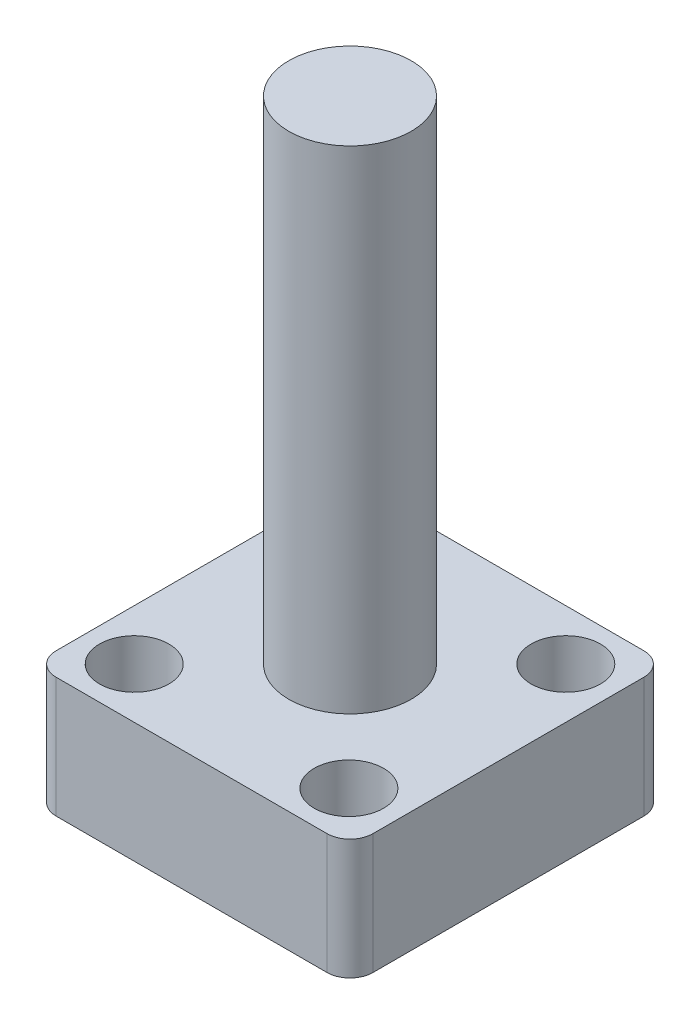
ISO-10303-21;
HEADER;
FILE_DESCRIPTION(('STEP AP214'),'2;1');
FILE_NAME('part.step','',(''),(''),'','','');
FILE_SCHEMA(('AUTOMOTIVE_DESIGN { 1 0 10303 214 1 1 1 1 }'));
ENDSEC;
DATA;
#1=APPLICATION_CONTEXT('core data for automotive mechanical design processes');
#2=APPLICATION_PROTOCOL_DEFINITION('international standard','automotive_design',2000,#1);
#3=PRODUCT_CONTEXT('',#1,'mechanical');
#4=PRODUCT('Part','Part','',(#3));
#5=PRODUCT_RELATED_PRODUCT_CATEGORY('part','',(#4));
#6=PRODUCT_DEFINITION_FORMATION('','',#4);
#7=PRODUCT_DEFINITION_CONTEXT('part definition',#1,'design');
#8=PRODUCT_DEFINITION('design','',#6,#7);
#9=PRODUCT_DEFINITION_SHAPE('','',#8);
#10=(LENGTH_UNIT() NAMED_UNIT(*) SI_UNIT(.MILLI.,.METRE.));
#11=(NAMED_UNIT(*) PLANE_ANGLE_UNIT() SI_UNIT($,.RADIAN.));
#12=(NAMED_UNIT(*) SI_UNIT($,.STERADIAN.) SOLID_ANGLE_UNIT());
#13=UNCERTAINTY_MEASURE_WITH_UNIT(LENGTH_MEASURE(1.E-05),#10,'distance_accuracy_value','');
#14=(GEOMETRIC_REPRESENTATION_CONTEXT(3) GLOBAL_UNCERTAINTY_ASSIGNED_CONTEXT((#13)) GLOBAL_UNIT_ASSIGNED_CONTEXT((#10,
#11,#12)) REPRESENTATION_CONTEXT('',''));
#15=CARTESIAN_POINT('',(0.,0.,0.));
#16=DIRECTION('',(0.,0.,1.));
#17=DIRECTION('',(1.,0.,0.));
#18=AXIS2_PLACEMENT_3D('',#15,#16,#17);
#19=CARTESIAN_POINT('',(-26.289,0.,-26.289));
#20=DIRECTION('',(0.,1.,0.));
#21=DIRECTION('',(0.,0.,1.));
#22=AXIS2_PLACEMENT_3D('',#19,#20,#21);
#23=PLANE('',#22);
#24=DIRECTION('',(0.,0.,1.));
#25=VECTOR('',#24,1.);
#26=CARTESIAN_POINT('',(-26.289,0.,26.289));
#27=LINE('',#26,#25);
#28=CARTESIAN_POINT('',(-26.289,0.,-22.479));
#29=VERTEX_POINT('',#28);
#30=CARTESIAN_POINT('',(-26.289,0.,22.479));
#31=VERTEX_POINT('',#30);
#32=EDGE_CURVE('E128',#29,#31,#27,.T.);
#33=ORIENTED_EDGE('',*,*,#32,.F.);
#34=CARTESIAN_POINT('',(-22.479,0.,-22.479));
#35=DIRECTION('',(0.,1.,0.));
#36=DIRECTION('',(0.,0.,1.));
#37=AXIS2_PLACEMENT_3D('',#34,#35,#36);
#38=CIRCLE('',#37,3.81);
#39=CARTESIAN_POINT('',(-22.479,0.,-26.289));
#40=VERTEX_POINT('',#39);
#41=EDGE_CURVE('E110',#29,#40,#38,.F.);
#42=ORIENTED_EDGE('',*,*,#41,.T.);
#43=DIRECTION('',(-1.,0.,0.));
#44=VECTOR('',#43,1.);
#45=CARTESIAN_POINT('',(26.289,0.,-26.289));
#46=LINE('',#45,#44);
#47=CARTESIAN_POINT('',(22.479,0.,-26.289));
#48=VERTEX_POINT('',#47);
#49=EDGE_CURVE('E157',#48,#40,#46,.T.);
#50=ORIENTED_EDGE('',*,*,#49,.F.);
#51=CARTESIAN_POINT('',(22.479,0.,-22.479));
#52=DIRECTION('',(0.,1.,0.));
#53=DIRECTION('',(0.,0.,1.));
#54=AXIS2_PLACEMENT_3D('',#51,#52,#53);
#55=CIRCLE('',#54,3.81);
#56=CARTESIAN_POINT('',(26.289,0.,-22.479));
#57=VERTEX_POINT('',#56);
#58=EDGE_CURVE('E122',#48,#57,#55,.F.);
#59=ORIENTED_EDGE('',*,*,#58,.T.);
#60=DIRECTION('',(0.,0.,-1.));
#61=VECTOR('',#60,1.);
#62=CARTESIAN_POINT('',(26.289,0.,26.289));
#63=LINE('',#62,#61);
#64=CARTESIAN_POINT('',(26.289,0.,22.479));
#65=VERTEX_POINT('',#64);
#66=EDGE_CURVE('E146',#65,#57,#63,.T.);
#67=ORIENTED_EDGE('',*,*,#66,.F.);
#68=CARTESIAN_POINT('',(22.479,0.,22.479));
#69=DIRECTION('',(0.,1.,0.));
#70=DIRECTION('',(0.,0.,1.));
#71=AXIS2_PLACEMENT_3D('',#68,#69,#70);
#72=CIRCLE('',#71,3.81);
#73=CARTESIAN_POINT('',(22.479,0.,26.289));
#74=VERTEX_POINT('',#73);
#75=EDGE_CURVE('E133',#65,#74,#72,.F.);
#76=ORIENTED_EDGE('',*,*,#75,.T.);
#77=DIRECTION('',(1.,0.,0.));
#78=VECTOR('',#77,1.);
#79=CARTESIAN_POINT('',(26.289,0.,26.289));
#80=LINE('',#79,#78);
#81=CARTESIAN_POINT('',(-22.479,0.,26.289));
#82=VERTEX_POINT('',#81);
#83=EDGE_CURVE('E140',#82,#74,#80,.T.);
#84=ORIENTED_EDGE('',*,*,#83,.F.);
#85=CARTESIAN_POINT('',(-22.479,0.,22.479));
#86=DIRECTION('',(0.,1.,0.));
#87=DIRECTION('',(0.,0.,1.));
#88=AXIS2_PLACEMENT_3D('',#85,#86,#87);
#89=CIRCLE('',#88,3.81);
#90=EDGE_CURVE('E138',#82,#31,#89,.F.);
#91=ORIENTED_EDGE('',*,*,#90,.T.);
#92=EDGE_LOOP('',(#33,#42,#50,#59,#67,#76,#84,#91));
#93=FACE_BOUND('',#92,.T.);
#94=CARTESIAN_POINT('',(-17.907,0.,-17.907));
#95=DIRECTION('',(0.,1.,0.));
#96=DIRECTION('',(0.,0.,1.));
#97=AXIS2_PLACEMENT_3D('',#94,#95,#96);
#98=CIRCLE('',#97,2.667);
#99=CARTESIAN_POINT('',(-17.907,0.,-15.24));
#100=VERTEX_POINT('',#99);
#101=EDGE_CURVE('E141',#100,#100,#98,.T.);
#102=ORIENTED_EDGE('',*,*,#101,.T.);
#103=EDGE_LOOP('',(#102));
#104=FACE_BOUND('',#103,.T.);
#105=CARTESIAN_POINT('',(-17.907,0.,17.907));
#106=DIRECTION('',(0.,1.,0.));
#107=DIRECTION('',(0.,0.,1.));
#108=AXIS2_PLACEMENT_3D('',#105,#106,#107);
#109=CIRCLE('',#108,2.667);
#110=CARTESIAN_POINT('',(-17.907,0.,20.574));
#111=VERTEX_POINT('',#110);
#112=EDGE_CURVE('E149',#111,#111,#109,.T.);
#113=ORIENTED_EDGE('',*,*,#112,.T.);
#114=EDGE_LOOP('',(#113));
#115=FACE_BOUND('',#114,.T.);
#116=CARTESIAN_POINT('',(17.907,0.,-17.907));
#117=DIRECTION('',(0.,1.,0.));
#118=DIRECTION('',(0.,0.,1.));
#119=AXIS2_PLACEMENT_3D('',#116,#117,#118);
#120=CIRCLE('',#119,2.667);
#121=CARTESIAN_POINT('',(17.907,0.,-15.24));
#122=VERTEX_POINT('',#121);
#123=EDGE_CURVE('E222',#122,#122,#120,.T.);
#124=ORIENTED_EDGE('',*,*,#123,.T.);
#125=EDGE_LOOP('',(#124));
#126=FACE_BOUND('',#125,.T.);
#127=CARTESIAN_POINT('',(18.0213147502904,0.,17.6956283391408));
#128=DIRECTION('',(0.,1.,0.));
#129=DIRECTION('',(0.,0.,1.));
#130=AXIS2_PLACEMENT_3D('',#127,#128,#129);
#131=CIRCLE('',#130,2.667);
#132=CARTESIAN_POINT('',(18.0213147502904,0.,20.3626283391408));
#133=VERTEX_POINT('',#132);
#134=EDGE_CURVE('E226',#133,#133,#131,.T.);
#135=ORIENTED_EDGE('',*,*,#134,.T.);
#136=EDGE_LOOP('',(#135));
#137=FACE_BOUND('',#136,.T.);
#138=ADVANCED_FACE('F41',(#93,#104,#115,#126,#137),#23,.F.);
#139=CARTESIAN_POINT('',(-26.289,19.9644,26.289));
#140=DIRECTION('',(1.,0.,0.));
#141=DIRECTION('',(0.,0.,-1.));
#142=AXIS2_PLACEMENT_3D('',#139,#140,#141);
#143=PLANE('',#142);
#144=DIRECTION('',(0.,0.,1.));
#145=VECTOR('',#144,1.);
#146=CARTESIAN_POINT('',(-26.289,19.9644,26.289));
#147=LINE('',#146,#145);
#148=CARTESIAN_POINT('',(-26.289,19.9644,-22.479));
#149=VERTEX_POINT('',#148);
#150=CARTESIAN_POINT('',(-26.289,19.9644,22.479));
#151=VERTEX_POINT('',#150);
#152=EDGE_CURVE('E131',#149,#151,#147,.T.);
#153=ORIENTED_EDGE('',*,*,#152,.F.);
#154=DIRECTION('',(0.,-1.,0.));
#155=VECTOR('',#154,1.);
#156=CARTESIAN_POINT('',(-26.289,19.9644,-22.479));
#157=LINE('',#156,#155);
#158=EDGE_CURVE('E114',#149,#29,#157,.T.);
#159=ORIENTED_EDGE('',*,*,#158,.T.);
#160=ORIENTED_EDGE('',*,*,#32,.T.);
#161=DIRECTION('',(0.,-1.,0.));
#162=VECTOR('',#161,1.);
#163=CARTESIAN_POINT('',(-26.289,19.9644,22.479));
#164=LINE('',#163,#162);
#165=EDGE_CURVE('E134',#31,#151,#164,.F.);
#166=ORIENTED_EDGE('',*,*,#165,.T.);
#167=EDGE_LOOP('',(#153,#159,#160,#166));
#168=FACE_BOUND('',#167,.T.);
#169=ADVANCED_FACE('F127',(#168),#143,.F.);
#170=CARTESIAN_POINT('',(26.289,19.9644,26.289));
#171=DIRECTION('',(0.,0.,-1.));
#172=DIRECTION('',(-1.,0.,0.));
#173=AXIS2_PLACEMENT_3D('',#170,#171,#172);
#174=PLANE('',#173);
#175=DIRECTION('',(1.,0.,0.));
#176=VECTOR('',#175,1.);
#177=CARTESIAN_POINT('',(26.289,19.9644,26.289));
#178=LINE('',#177,#176);
#179=CARTESIAN_POINT('',(-22.479,19.9644,26.289));
#180=VERTEX_POINT('',#179);
#181=CARTESIAN_POINT('',(22.479,19.9644,26.289));
#182=VERTEX_POINT('',#181);
#183=EDGE_CURVE('E195',#180,#182,#178,.T.);
#184=ORIENTED_EDGE('',*,*,#183,.F.);
#185=DIRECTION('',(0.,-1.,0.));
#186=VECTOR('',#185,1.);
#187=CARTESIAN_POINT('',(-22.479,19.9644,26.289));
#188=LINE('',#187,#186);
#189=EDGE_CURVE('E11',#180,#82,#188,.T.);
#190=ORIENTED_EDGE('',*,*,#189,.T.);
#191=ORIENTED_EDGE('',*,*,#83,.T.);
#192=DIRECTION('',(0.,-1.,0.));
#193=VECTOR('',#192,1.);
#194=CARTESIAN_POINT('',(22.479,19.9644,26.289));
#195=LINE('',#194,#193);
#196=EDGE_CURVE('E51',#74,#182,#195,.F.);
#197=ORIENTED_EDGE('',*,*,#196,.T.);
#198=EDGE_LOOP('',(#184,#190,#191,#197));
#199=FACE_BOUND('',#198,.T.);
#200=ADVANCED_FACE('F194',(#199),#174,.F.);
#201=CARTESIAN_POINT('',(26.289,19.9644,26.289));
#202=DIRECTION('',(-1.,0.,0.));
#203=DIRECTION('',(0.,0.,1.));
#204=AXIS2_PLACEMENT_3D('',#201,#202,#203);
#205=PLANE('',#204);
#206=ORIENTED_EDGE('',*,*,#66,.T.);
#207=DIRECTION('',(0.,-1.,0.));
#208=VECTOR('',#207,1.);
#209=CARTESIAN_POINT('',(26.289,19.9644,-22.479));
#210=LINE('',#209,#208);
#211=CARTESIAN_POINT('',(26.289,19.9644,-22.479));
#212=VERTEX_POINT('',#211);
#213=EDGE_CURVE('E58',#57,#212,#210,.F.);
#214=ORIENTED_EDGE('',*,*,#213,.T.);
#215=DIRECTION('',(0.,0.,-1.));
#216=VECTOR('',#215,1.);
#217=CARTESIAN_POINT('',(26.289,19.9644,26.289));
#218=LINE('',#217,#216);
#219=CARTESIAN_POINT('',(26.289,19.9644,22.479));
#220=VERTEX_POINT('',#219);
#221=EDGE_CURVE('E202',#220,#212,#218,.T.);
#222=ORIENTED_EDGE('',*,*,#221,.F.);
#223=DIRECTION('',(0.,-1.,0.));
#224=VECTOR('',#223,1.);
#225=CARTESIAN_POINT('',(26.289,19.9644,22.479));
#226=LINE('',#225,#224);
#227=EDGE_CURVE('E184',#220,#65,#226,.T.);
#228=ORIENTED_EDGE('',*,*,#227,.T.);
#229=EDGE_LOOP('',(#206,#214,#222,#228));
#230=FACE_BOUND('',#229,.T.);
#231=ADVANCED_FACE('F206',(#230),#205,.F.);
#232=CARTESIAN_POINT('',(26.289,19.9644,-26.289));
#233=DIRECTION('',(0.,0.,1.));
#234=DIRECTION('',(1.,0.,0.));
#235=AXIS2_PLACEMENT_3D('',#232,#233,#234);
#236=PLANE('',#235);
#237=ORIENTED_EDGE('',*,*,#49,.T.);
#238=DIRECTION('',(0.,-1.,0.));
#239=VECTOR('',#238,1.);
#240=CARTESIAN_POINT('',(-22.479,19.9644,-26.289));
#241=LINE('',#240,#239);
#242=CARTESIAN_POINT('',(-22.479,19.9644,-26.289));
#243=VERTEX_POINT('',#242);
#244=EDGE_CURVE('E115',#40,#243,#241,.F.);
#245=ORIENTED_EDGE('',*,*,#244,.T.);
#246=DIRECTION('',(-1.,0.,0.));
#247=VECTOR('',#246,1.);
#248=CARTESIAN_POINT('',(26.289,19.9644,-26.289));
#249=LINE('',#248,#247);
#250=CARTESIAN_POINT('',(22.479,19.9644,-26.289));
#251=VERTEX_POINT('',#250);
#252=EDGE_CURVE('E152',#251,#243,#249,.T.);
#253=ORIENTED_EDGE('',*,*,#252,.F.);
#254=DIRECTION('',(0.,-1.,0.));
#255=VECTOR('',#254,1.);
#256=CARTESIAN_POINT('',(22.479,19.9644,-26.289));
#257=LINE('',#256,#255);
#258=EDGE_CURVE('E121',#251,#48,#257,.T.);
#259=ORIENTED_EDGE('',*,*,#258,.T.);
#260=EDGE_LOOP('',(#237,#245,#253,#259));
#261=FACE_BOUND('',#260,.T.);
#262=ADVANCED_FACE('F213',(#261),#236,.F.);
#263=CARTESIAN_POINT('',(-26.289,19.9644,-26.289));
#264=DIRECTION('',(0.,1.,0.));
#265=DIRECTION('',(0.,0.,1.));
#266=AXIS2_PLACEMENT_3D('',#263,#264,#265);
#267=PLANE('',#266);
#268=CARTESIAN_POINT('',(0.,19.9644,0.));
#269=DIRECTION('',(0.,1.,0.));
#270=DIRECTION('',(0.,0.,1.));
#271=AXIS2_PLACEMENT_3D('',#268,#269,#270);
#272=CIRCLE('',#271,10.16);
#273=CARTESIAN_POINT('',(0.,19.9644,10.16));
#274=VERTEX_POINT('',#273);
#275=EDGE_CURVE('E45',#274,#274,#272,.F.);
#276=ORIENTED_EDGE('',*,*,#275,.T.);
#277=EDGE_LOOP('',(#276));
#278=FACE_BOUND('',#277,.T.);
#279=CARTESIAN_POINT('',(17.907,19.9644,-17.907));
#280=DIRECTION('',(0.,1.,0.));
#281=DIRECTION('',(0.,0.,1.));
#282=AXIS2_PLACEMENT_3D('',#279,#280,#281);
#283=CIRCLE('',#282,5.75437);
#284=CARTESIAN_POINT('',(17.907,19.9644,-12.15263));
#285=VERTEX_POINT('',#284);
#286=EDGE_CURVE('E274',#285,#285,#283,.T.);
#287=ORIENTED_EDGE('',*,*,#286,.F.);
#288=EDGE_LOOP('',(#287));
#289=FACE_BOUND('',#288,.T.);
#290=CARTESIAN_POINT('',(17.7728365538147,19.9644,17.9563280903823));
#291=DIRECTION('',(0.,1.,0.));
#292=DIRECTION('',(0.,0.,1.));
#293=AXIS2_PLACEMENT_3D('',#290,#291,#292);
#294=CIRCLE('',#293,5.75437);
#295=CARTESIAN_POINT('',(17.7728365538147,19.9644,23.7106980903823));
#296=VERTEX_POINT('',#295);
#297=EDGE_CURVE('E262',#296,#296,#294,.T.);
#298=ORIENTED_EDGE('',*,*,#297,.F.);
#299=EDGE_LOOP('',(#298));
#300=FACE_BOUND('',#299,.T.);
#301=CARTESIAN_POINT('',(-17.907,19.9644,17.907));
#302=DIRECTION('',(0.,1.,0.));
#303=DIRECTION('',(0.,0.,1.));
#304=AXIS2_PLACEMENT_3D('',#301,#302,#303);
#305=CIRCLE('',#304,5.75437);
#306=CARTESIAN_POINT('',(-17.907,19.9644,23.66137));
#307=VERTEX_POINT('',#306);
#308=EDGE_CURVE('E250',#307,#307,#305,.T.);
#309=ORIENTED_EDGE('',*,*,#308,.F.);
#310=EDGE_LOOP('',(#309));
#311=FACE_BOUND('',#310,.T.);
#312=CARTESIAN_POINT('',(-17.907,19.9644,-17.907));
#313=DIRECTION('',(0.,1.,0.));
#314=DIRECTION('',(0.,0.,1.));
#315=AXIS2_PLACEMENT_3D('',#312,#313,#314);
#316=CIRCLE('',#315,5.75437);
#317=CARTESIAN_POINT('',(-17.907,19.9644,-12.15263));
#318=VERTEX_POINT('',#317);
#319=EDGE_CURVE('E238',#318,#318,#316,.T.);
#320=ORIENTED_EDGE('',*,*,#319,.F.);
#321=EDGE_LOOP('',(#320));
#322=FACE_BOUND('',#321,.T.);
#323=ORIENTED_EDGE('',*,*,#252,.T.);
#324=CARTESIAN_POINT('',(-22.479,19.9644,-22.479));
#325=DIRECTION('',(0.,1.,0.));
#326=DIRECTION('',(0.,0.,1.));
#327=AXIS2_PLACEMENT_3D('',#324,#325,#326);
#328=CIRCLE('',#327,3.81);
#329=EDGE_CURVE('E181',#243,#149,#328,.T.);
#330=ORIENTED_EDGE('',*,*,#329,.T.);
#331=ORIENTED_EDGE('',*,*,#152,.T.);
#332=CARTESIAN_POINT('',(-22.479,19.9644,22.479));
#333=DIRECTION('',(0.,1.,0.));
#334=DIRECTION('',(0.,0.,1.));
#335=AXIS2_PLACEMENT_3D('',#332,#333,#334);
#336=CIRCLE('',#335,3.81);
#337=EDGE_CURVE('E175',#151,#180,#336,.T.);
#338=ORIENTED_EDGE('',*,*,#337,.T.);
#339=ORIENTED_EDGE('',*,*,#183,.T.);
#340=CARTESIAN_POINT('',(22.479,19.9644,22.479));
#341=DIRECTION('',(0.,1.,0.));
#342=DIRECTION('',(0.,0.,1.));
#343=AXIS2_PLACEMENT_3D('',#340,#341,#342);
#344=CIRCLE('',#343,3.81);
#345=EDGE_CURVE('E65',#182,#220,#344,.T.);
#346=ORIENTED_EDGE('',*,*,#345,.T.);
#347=ORIENTED_EDGE('',*,*,#221,.T.);
#348=CARTESIAN_POINT('',(22.479,19.9644,-22.479));
#349=DIRECTION('',(0.,1.,0.));
#350=DIRECTION('',(0.,0.,1.));
#351=AXIS2_PLACEMENT_3D('',#348,#349,#350);
#352=CIRCLE('',#351,3.81);
#353=EDGE_CURVE('E178',#212,#251,#352,.T.);
#354=ORIENTED_EDGE('',*,*,#353,.T.);
#355=EDGE_LOOP('',(#323,#330,#331,#338,#339,#346,#347,#354));
#356=FACE_BOUND('',#355,.T.);
#357=ADVANCED_FACE('F199',(#278,#289,#300,#311,#322,#356),#267,.T.);
#358=CARTESIAN_POINT('',(-17.907,5.7658,-17.907));
#359=DIRECTION('',(0.,-1.,0.));
#360=DIRECTION('',(0.,0.,-1.));
#361=AXIS2_PLACEMENT_3D('',#358,#359,#360);
#362=CYLINDRICAL_SURFACE('',#361,2.667);
#363=CARTESIAN_POINT('',(-17.907,5.7658,-17.907));
#364=DIRECTION('',(0.,1.,0.));
#365=DIRECTION('',(0.,0.,1.));
#366=AXIS2_PLACEMENT_3D('',#363,#364,#365);
#367=CIRCLE('',#366,2.667);
#368=CARTESIAN_POINT('',(-17.907,5.7658,-15.24));
#369=VERTEX_POINT('',#368);
#370=EDGE_CURVE('E230',#369,#369,#367,.T.);
#371=ORIENTED_EDGE('',*,*,#370,.T.);
#372=EDGE_LOOP('',(#371));
#373=FACE_BOUND('',#372,.T.);
#374=ORIENTED_EDGE('',*,*,#101,.F.);
#375=EDGE_LOOP('',(#374));
#376=FACE_BOUND('',#375,.T.);
#377=ADVANCED_FACE('F344',(#373,#376),#362,.F.);
#378=CARTESIAN_POINT('',(-17.907,5.7658,17.907));
#379=DIRECTION('',(0.,-1.,0.));
#380=DIRECTION('',(0.,0.,-1.));
#381=AXIS2_PLACEMENT_3D('',#378,#379,#380);
#382=CYLINDRICAL_SURFACE('',#381,2.667);
#383=CARTESIAN_POINT('',(-17.907,5.7658,17.907));
#384=DIRECTION('',(0.,1.,0.));
#385=DIRECTION('',(0.,0.,1.));
#386=AXIS2_PLACEMENT_3D('',#383,#384,#385);
#387=CIRCLE('',#386,2.667);
#388=CARTESIAN_POINT('',(-17.907,5.7658,20.574));
#389=VERTEX_POINT('',#388);
#390=EDGE_CURVE('E242',#389,#389,#387,.T.);
#391=ORIENTED_EDGE('',*,*,#390,.T.);
#392=EDGE_LOOP('',(#391));
#393=FACE_BOUND('',#392,.T.);
#394=ORIENTED_EDGE('',*,*,#112,.F.);
#395=EDGE_LOOP('',(#394));
#396=FACE_BOUND('',#395,.T.);
#397=ADVANCED_FACE('F364',(#393,#396),#382,.F.);
#398=CARTESIAN_POINT('',(17.907,5.7658,-17.907));
#399=DIRECTION('',(0.,-1.,0.));
#400=DIRECTION('',(0.,0.,-1.));
#401=AXIS2_PLACEMENT_3D('',#398,#399,#400);
#402=CYLINDRICAL_SURFACE('',#401,2.667);
#403=CARTESIAN_POINT('',(17.907,5.7658,-17.907));
#404=DIRECTION('',(0.,1.,0.));
#405=DIRECTION('',(0.,0.,1.));
#406=AXIS2_PLACEMENT_3D('',#403,#404,#405);
#407=CIRCLE('',#406,2.667);
#408=CARTESIAN_POINT('',(17.907,5.7658,-15.24));
#409=VERTEX_POINT('',#408);
#410=EDGE_CURVE('E266',#409,#409,#407,.T.);
#411=ORIENTED_EDGE('',*,*,#410,.T.);
#412=EDGE_LOOP('',(#411));
#413=FACE_BOUND('',#412,.T.);
#414=ORIENTED_EDGE('',*,*,#123,.F.);
#415=EDGE_LOOP('',(#414));
#416=FACE_BOUND('',#415,.T.);
#417=ADVANCED_FACE('F370',(#413,#416),#402,.F.);
#418=CARTESIAN_POINT('',(18.0213147502904,5.7658,17.6956283391408));
#419=DIRECTION('',(0.,-1.,0.));
#420=DIRECTION('',(0.,0.,-1.));
#421=AXIS2_PLACEMENT_3D('',#418,#419,#420);
#422=CYLINDRICAL_SURFACE('',#421,2.667);
#423=CARTESIAN_POINT('',(18.0213147502904,5.7658,17.6956283391408));
#424=DIRECTION('',(0.,1.,0.));
#425=DIRECTION('',(0.,0.,1.));
#426=AXIS2_PLACEMENT_3D('',#423,#424,#425);
#427=CIRCLE('',#426,2.667);
#428=CARTESIAN_POINT('',(18.0213147502904,5.7658,20.3626283391408));
#429=VERTEX_POINT('',#428);
#430=EDGE_CURVE('E254',#429,#429,#427,.T.);
#431=ORIENTED_EDGE('',*,*,#430,.T.);
#432=EDGE_LOOP('',(#431));
#433=FACE_BOUND('',#432,.T.);
#434=ORIENTED_EDGE('',*,*,#134,.F.);
#435=EDGE_LOOP('',(#434));
#436=FACE_BOUND('',#435,.T.);
#437=ADVANCED_FACE('F378',(#433,#436),#422,.F.);
#438=CARTESIAN_POINT('',(-17.907,-10.5100161938257,-17.907));
#439=DIRECTION('',(0.,1.,0.));
#440=DIRECTION('',(0.,0.,1.));
#441=AXIS2_PLACEMENT_3D('',#438,#439,#440);
#442=CYLINDRICAL_SURFACE('',#441,5.75437);
#443=CARTESIAN_POINT('',(-17.907,5.7658,-17.907));
#444=DIRECTION('',(0.,1.,0.));
#445=DIRECTION('',(0.,0.,1.));
#446=AXIS2_PLACEMENT_3D('',#443,#444,#445);
#447=CIRCLE('',#446,5.75437);
#448=CARTESIAN_POINT('',(-17.907,5.7658,-12.15263));
#449=VERTEX_POINT('',#448);
#450=EDGE_CURVE('E234',#449,#449,#447,.F.);
#451=ORIENTED_EDGE('',*,*,#450,.T.);
#452=EDGE_LOOP('',(#451));
#453=FACE_BOUND('',#452,.T.);
#454=ORIENTED_EDGE('',*,*,#319,.T.);
#455=EDGE_LOOP('',(#454));
#456=FACE_BOUND('',#455,.T.);
#457=ADVANCED_FACE('F386',(#453,#456),#442,.F.);
#458=CARTESIAN_POINT('',(17.907,5.7658,-17.907));
#459=DIRECTION('',(0.,1.,0.));
#460=DIRECTION('',(0.,0.,1.));
#461=AXIS2_PLACEMENT_3D('',#458,#459,#460);
#462=PLANE('',#461);
#463=ORIENTED_EDGE('',*,*,#370,.F.);
#464=EDGE_LOOP('',(#463));
#465=FACE_BOUND('',#464,.T.);
#466=ORIENTED_EDGE('',*,*,#450,.F.);
#467=EDGE_LOOP('',(#466));
#468=FACE_BOUND('',#467,.T.);
#469=ADVANCED_FACE('F394',(#465,#468),#462,.T.);
#470=CARTESIAN_POINT('',(-17.907,-10.5100161938257,17.907));
#471=DIRECTION('',(0.,1.,0.));
#472=DIRECTION('',(0.,0.,1.));
#473=AXIS2_PLACEMENT_3D('',#470,#471,#472);
#474=CYLINDRICAL_SURFACE('',#473,5.75437);
#475=CARTESIAN_POINT('',(-17.907,5.7658,17.907));
#476=DIRECTION('',(0.,1.,0.));
#477=DIRECTION('',(0.,0.,1.));
#478=AXIS2_PLACEMENT_3D('',#475,#476,#477);
#479=CIRCLE('',#478,5.75437);
#480=CARTESIAN_POINT('',(-17.907,5.7658,23.66137));
#481=VERTEX_POINT('',#480);
#482=EDGE_CURVE('E246',#481,#481,#479,.F.);
#483=ORIENTED_EDGE('',*,*,#482,.T.);
#484=EDGE_LOOP('',(#483));
#485=FACE_BOUND('',#484,.T.);
#486=ORIENTED_EDGE('',*,*,#308,.T.);
#487=EDGE_LOOP('',(#486));
#488=FACE_BOUND('',#487,.T.);
#489=ADVANCED_FACE('F402',(#485,#488),#474,.F.);
#490=CARTESIAN_POINT('',(17.907,5.7658,-17.907));
#491=DIRECTION('',(0.,1.,0.));
#492=DIRECTION('',(0.,0.,1.));
#493=AXIS2_PLACEMENT_3D('',#490,#491,#492);
#494=PLANE('',#493);
#495=ORIENTED_EDGE('',*,*,#390,.F.);
#496=EDGE_LOOP('',(#495));
#497=FACE_BOUND('',#496,.T.);
#498=ORIENTED_EDGE('',*,*,#482,.F.);
#499=EDGE_LOOP('',(#498));
#500=FACE_BOUND('',#499,.T.);
#501=ADVANCED_FACE('F410',(#497,#500),#494,.T.);
#502=CARTESIAN_POINT('',(17.7728365538147,-10.5100161938257,17.9563280903823));
#503=DIRECTION('',(0.,1.,0.));
#504=DIRECTION('',(0.,0.,1.));
#505=AXIS2_PLACEMENT_3D('',#502,#503,#504);
#506=CYLINDRICAL_SURFACE('',#505,5.75437);
#507=CARTESIAN_POINT('',(17.7728365538147,5.7658,17.9563280903823));
#508=DIRECTION('',(0.,1.,0.));
#509=DIRECTION('',(0.,0.,1.));
#510=AXIS2_PLACEMENT_3D('',#507,#508,#509);
#511=CIRCLE('',#510,5.75437);
#512=CARTESIAN_POINT('',(17.7728365538147,5.7658,23.7106980903823));
#513=VERTEX_POINT('',#512);
#514=EDGE_CURVE('E258',#513,#513,#511,.F.);
#515=ORIENTED_EDGE('',*,*,#514,.T.);
#516=EDGE_LOOP('',(#515));
#517=FACE_BOUND('',#516,.T.);
#518=ORIENTED_EDGE('',*,*,#297,.T.);
#519=EDGE_LOOP('',(#518));
#520=FACE_BOUND('',#519,.T.);
#521=ADVANCED_FACE('F418',(#517,#520),#506,.F.);
#522=CARTESIAN_POINT('',(17.907,5.7658,-17.907));
#523=DIRECTION('',(0.,1.,0.));
#524=DIRECTION('',(0.,0.,1.));
#525=AXIS2_PLACEMENT_3D('',#522,#523,#524);
#526=PLANE('',#525);
#527=ORIENTED_EDGE('',*,*,#430,.F.);
#528=EDGE_LOOP('',(#527));
#529=FACE_BOUND('',#528,.T.);
#530=ORIENTED_EDGE('',*,*,#514,.F.);
#531=EDGE_LOOP('',(#530));
#532=FACE_BOUND('',#531,.T.);
#533=ADVANCED_FACE('F426',(#529,#532),#526,.T.);
#534=CARTESIAN_POINT('',(17.907,-10.5100161938257,-17.907));
#535=DIRECTION('',(0.,1.,0.));
#536=DIRECTION('',(0.,0.,1.));
#537=AXIS2_PLACEMENT_3D('',#534,#535,#536);
#538=CYLINDRICAL_SURFACE('',#537,5.75437);
#539=CARTESIAN_POINT('',(17.907,5.7658,-17.907));
#540=DIRECTION('',(0.,1.,0.));
#541=DIRECTION('',(0.,0.,1.));
#542=AXIS2_PLACEMENT_3D('',#539,#540,#541);
#543=CIRCLE('',#542,5.75437);
#544=CARTESIAN_POINT('',(17.907,5.7658,-12.15263));
#545=VERTEX_POINT('',#544);
#546=EDGE_CURVE('E270',#545,#545,#543,.F.);
#547=ORIENTED_EDGE('',*,*,#546,.T.);
#548=EDGE_LOOP('',(#547));
#549=FACE_BOUND('',#548,.T.);
#550=ORIENTED_EDGE('',*,*,#286,.T.);
#551=EDGE_LOOP('',(#550));
#552=FACE_BOUND('',#551,.T.);
#553=ADVANCED_FACE('F434',(#549,#552),#538,.F.);
#554=CARTESIAN_POINT('',(17.907,5.7658,-17.907));
#555=DIRECTION('',(0.,1.,0.));
#556=DIRECTION('',(0.,0.,1.));
#557=AXIS2_PLACEMENT_3D('',#554,#555,#556);
#558=PLANE('',#557);
#559=ORIENTED_EDGE('',*,*,#410,.F.);
#560=EDGE_LOOP('',(#559));
#561=FACE_BOUND('',#560,.T.);
#562=ORIENTED_EDGE('',*,*,#546,.F.);
#563=EDGE_LOOP('',(#562));
#564=FACE_BOUND('',#563,.T.);
#565=ADVANCED_FACE('F318',(#561,#564),#558,.T.);
#566=CARTESIAN_POINT('',(-22.479,19.9644,-22.479));
#567=DIRECTION('',(0.,-1.,0.));
#568=DIRECTION('',(0.,0.,-1.));
#569=AXIS2_PLACEMENT_3D('',#566,#567,#568);
#570=CYLINDRICAL_SURFACE('',#569,3.81);
#571=ORIENTED_EDGE('',*,*,#329,.F.);
#572=ORIENTED_EDGE('',*,*,#244,.F.);
#573=ORIENTED_EDGE('',*,*,#41,.F.);
#574=ORIENTED_EDGE('',*,*,#158,.F.);
#575=EDGE_LOOP('',(#571,#572,#573,#574));
#576=FACE_BOUND('',#575,.T.);
#577=ADVANCED_FACE('F113',(#576),#570,.T.);
#578=CARTESIAN_POINT('',(22.479,19.9644,-22.479));
#579=DIRECTION('',(0.,-1.,0.));
#580=DIRECTION('',(0.,0.,-1.));
#581=AXIS2_PLACEMENT_3D('',#578,#579,#580);
#582=CYLINDRICAL_SURFACE('',#581,3.81);
#583=ORIENTED_EDGE('',*,*,#353,.F.);
#584=ORIENTED_EDGE('',*,*,#213,.F.);
#585=ORIENTED_EDGE('',*,*,#58,.F.);
#586=ORIENTED_EDGE('',*,*,#258,.F.);
#587=EDGE_LOOP('',(#583,#584,#585,#586));
#588=FACE_BOUND('',#587,.T.);
#589=ADVANCED_FACE('F210',(#588),#582,.T.);
#590=CARTESIAN_POINT('',(-22.479,19.9644,22.479));
#591=DIRECTION('',(0.,-1.,0.));
#592=DIRECTION('',(0.,0.,-1.));
#593=AXIS2_PLACEMENT_3D('',#590,#591,#592);
#594=CYLINDRICAL_SURFACE('',#593,3.81);
#595=ORIENTED_EDGE('',*,*,#337,.F.);
#596=ORIENTED_EDGE('',*,*,#165,.F.);
#597=ORIENTED_EDGE('',*,*,#90,.F.);
#598=ORIENTED_EDGE('',*,*,#189,.F.);
#599=EDGE_LOOP('',(#595,#596,#597,#598));
#600=FACE_BOUND('',#599,.T.);
#601=ADVANCED_FACE('F299',(#600),#594,.T.);
#602=CARTESIAN_POINT('',(22.479,19.9644,22.479));
#603=DIRECTION('',(0.,-1.,0.));
#604=DIRECTION('',(0.,0.,-1.));
#605=AXIS2_PLACEMENT_3D('',#602,#603,#604);
#606=CYLINDRICAL_SURFACE('',#605,3.81);
#607=ORIENTED_EDGE('',*,*,#345,.F.);
#608=ORIENTED_EDGE('',*,*,#196,.F.);
#609=ORIENTED_EDGE('',*,*,#75,.F.);
#610=ORIENTED_EDGE('',*,*,#227,.F.);
#611=EDGE_LOOP('',(#607,#608,#609,#610));
#612=FACE_BOUND('',#611,.T.);
#613=ADVANCED_FACE('F43',(#612),#606,.T.);
#614=CARTESIAN_POINT('',(0.,101.6,0.));
#615=DIRECTION('',(0.,-1.,0.));
#616=DIRECTION('',(0.,0.,-1.));
#617=AXIS2_PLACEMENT_3D('',#614,#615,#616);
#618=CYLINDRICAL_SURFACE('',#617,10.16);
#619=ORIENTED_EDGE('',*,*,#275,.F.);
#620=EDGE_LOOP('',(#619));
#621=FACE_BOUND('',#620,.T.);
#622=CARTESIAN_POINT('',(0.,101.6,0.));
#623=DIRECTION('',(0.,1.,0.));
#624=DIRECTION('',(0.,0.,1.));
#625=AXIS2_PLACEMENT_3D('',#622,#623,#624);
#626=CIRCLE('',#625,10.16);
#627=CARTESIAN_POINT('',(0.,101.6,10.16));
#628=VERTEX_POINT('',#627);
#629=EDGE_CURVE('E278',#628,#628,#626,.T.);
#630=ORIENTED_EDGE('',*,*,#629,.F.);
#631=EDGE_LOOP('',(#630));
#632=FACE_BOUND('',#631,.T.);
#633=ADVANCED_FACE('F289',(#621,#632),#618,.T.);
#634=CARTESIAN_POINT('',(0.,101.6,0.));
#635=DIRECTION('',(0.,1.,0.));
#636=DIRECTION('',(0.,0.,1.));
#637=AXIS2_PLACEMENT_3D('',#634,#635,#636);
#638=PLANE('',#637);
#639=ORIENTED_EDGE('',*,*,#629,.T.);
#640=EDGE_LOOP('',(#639));
#641=FACE_BOUND('',#640,.T.);
#642=ADVANCED_FACE('F292',(#641),#638,.T.);
#643=CLOSED_SHELL('',(#138,#169,#200,#231,#262,#357,#377,#397,#417,#437,#457,#469,#489,#501,
#521,#533,#553,#565,#577,#589,#601,#613,#633,#642));
#644=MANIFOLD_SOLID_BREP('B2',#643);
#645=ADVANCED_BREP_SHAPE_REPRESENTATION('',(#18,#644),#14);
#646=SHAPE_DEFINITION_REPRESENTATION(#9,#645);
ENDSEC;
END-ISO-10303-21;
